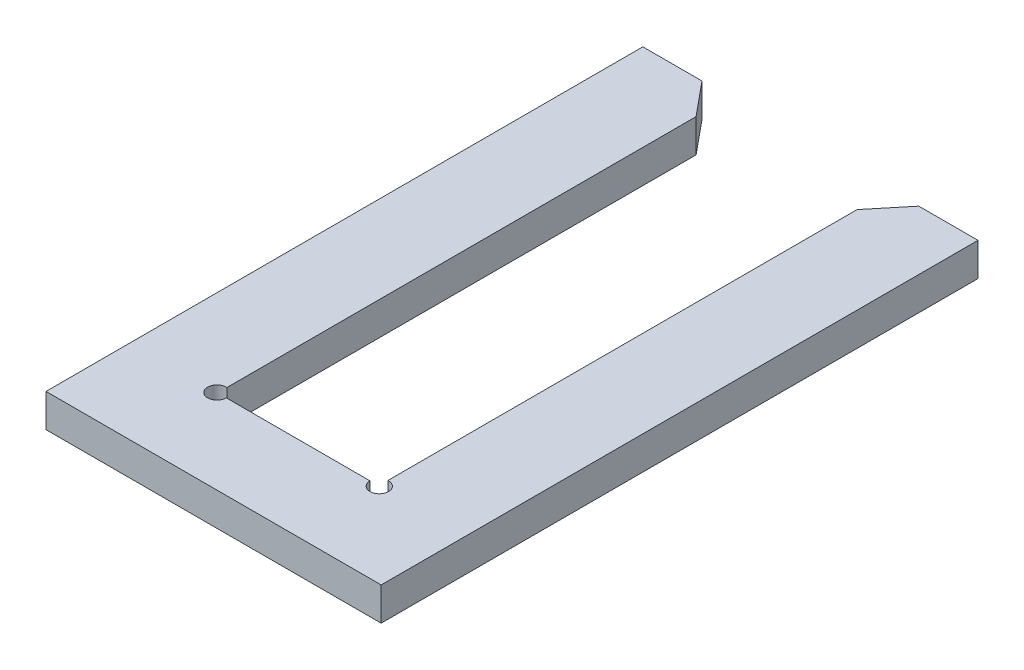
ISO-10303-21;
HEADER;
FILE_DESCRIPTION(('STEP AP214'),'2;1');
FILE_NAME('part.step','',(''),(''),'','','');
FILE_SCHEMA(('AUTOMOTIVE_DESIGN { 1 0 10303 214 1 1 1 1 }'));
ENDSEC;
DATA;
#1=APPLICATION_CONTEXT('core data for automotive mechanical design processes');
#2=APPLICATION_PROTOCOL_DEFINITION('international standard','automotive_design',2000,#1);
#3=PRODUCT_CONTEXT('',#1,'mechanical');
#4=PRODUCT('Part','Part','',(#3));
#5=PRODUCT_RELATED_PRODUCT_CATEGORY('part','',(#4));
#6=PRODUCT_DEFINITION_FORMATION('','',#4);
#7=PRODUCT_DEFINITION_CONTEXT('part definition',#1,'design');
#8=PRODUCT_DEFINITION('design','',#6,#7);
#9=PRODUCT_DEFINITION_SHAPE('','',#8);
#10=(LENGTH_UNIT() NAMED_UNIT(*) SI_UNIT(.MILLI.,.METRE.));
#11=(NAMED_UNIT(*) PLANE_ANGLE_UNIT() SI_UNIT($,.RADIAN.));
#12=(NAMED_UNIT(*) SI_UNIT($,.STERADIAN.) SOLID_ANGLE_UNIT());
#13=UNCERTAINTY_MEASURE_WITH_UNIT(LENGTH_MEASURE(1.E-05),#10,'distance_accuracy_value','');
#14=(GEOMETRIC_REPRESENTATION_CONTEXT(3) GLOBAL_UNCERTAINTY_ASSIGNED_CONTEXT((#13)) GLOBAL_UNIT_ASSIGNED_CONTEXT((#10,
#11,#12)) REPRESENTATION_CONTEXT('',''));
#15=CARTESIAN_POINT('',(0.,0.,0.));
#16=DIRECTION('',(0.,0.,1.));
#17=DIRECTION('',(1.,0.,0.));
#18=AXIS2_PLACEMENT_3D('',#15,#16,#17);
#19=CARTESIAN_POINT('',(0.,1.96,0.));
#20=DIRECTION('',(0.,0.,-1.));
#21=DIRECTION('',(-1.,0.,0.));
#22=AXIS2_PLACEMENT_3D('',#19,#20,#21);
#23=PLANE('',#22);
#24=DIRECTION('',(1.,0.,0.));
#25=VECTOR('',#24,1.);
#26=CARTESIAN_POINT('',(0.,0.,0.));
#27=LINE('',#26,#25);
#28=CARTESIAN_POINT('',(-9.91136363636364,0.,0.));
#29=VERTEX_POINT('',#28);
#30=CARTESIAN_POINT('',(9.91136363636364,0.,0.));
#31=VERTEX_POINT('',#30);
#32=EDGE_CURVE('E107',#29,#31,#27,.T.);
#33=ORIENTED_EDGE('',*,*,#32,.T.);
#34=DIRECTION('',(0.,-1.,0.));
#35=VECTOR('',#34,1.);
#36=CARTESIAN_POINT('',(9.91136363636364,1.96,0.));
#37=LINE('',#36,#35);
#38=CARTESIAN_POINT('',(9.91136363636364,1.96,0.));
#39=VERTEX_POINT('',#38);
#40=EDGE_CURVE('E10',#39,#31,#37,.T.);
#41=ORIENTED_EDGE('',*,*,#40,.F.);
#42=DIRECTION('',(1.,0.,0.));
#43=VECTOR('',#42,1.);
#44=CARTESIAN_POINT('',(0.,1.96,0.));
#45=LINE('',#44,#43);
#46=CARTESIAN_POINT('',(-9.91136363636364,1.96,0.));
#47=VERTEX_POINT('',#46);
#48=EDGE_CURVE('E70',#47,#39,#45,.T.);
#49=ORIENTED_EDGE('',*,*,#48,.F.);
#50=DIRECTION('',(0.,-1.,0.));
#51=VECTOR('',#50,1.);
#52=CARTESIAN_POINT('',(-9.91136363636364,1.96,0.));
#53=LINE('',#52,#51);
#54=EDGE_CURVE('E166',#47,#29,#53,.T.);
#55=ORIENTED_EDGE('',*,*,#54,.T.);
#56=EDGE_LOOP('',(#33,#41,#49,#55));
#57=FACE_BOUND('',#56,.T.);
#58=ADVANCED_FACE('F16',(#57),#23,.F.);
#59=CARTESIAN_POINT('',(9.91136363636364,1.96,0.));
#60=DIRECTION('',(-1.,0.,0.));
#61=DIRECTION('',(0.,0.,1.));
#62=AXIS2_PLACEMENT_3D('',#59,#60,#61);
#63=PLANE('',#62);
#64=DIRECTION('',(0.,0.,-1.));
#65=VECTOR('',#64,1.);
#66=CARTESIAN_POINT('',(9.91136363636364,0.,0.));
#67=LINE('',#66,#65);
#68=CARTESIAN_POINT('',(9.91136363636364,0.,-35.3));
#69=VERTEX_POINT('',#68);
#70=EDGE_CURVE('E109',#31,#69,#67,.T.);
#71=ORIENTED_EDGE('',*,*,#70,.T.);
#72=DIRECTION('',(0.,-1.,0.));
#73=VECTOR('',#72,1.);
#74=CARTESIAN_POINT('',(9.91136363636364,1.96,-35.3));
#75=LINE('',#74,#73);
#76=CARTESIAN_POINT('',(9.91136363636364,1.96,-35.3));
#77=VERTEX_POINT('',#76);
#78=EDGE_CURVE('E24',#77,#69,#75,.T.);
#79=ORIENTED_EDGE('',*,*,#78,.F.);
#80=DIRECTION('',(0.,0.,-1.));
#81=VECTOR('',#80,1.);
#82=CARTESIAN_POINT('',(9.91136363636364,1.96,0.));
#83=LINE('',#82,#81);
#84=EDGE_CURVE('E161',#39,#77,#83,.T.);
#85=ORIENTED_EDGE('',*,*,#84,.F.);
#86=ORIENTED_EDGE('',*,*,#40,.T.);
#87=EDGE_LOOP('',(#71,#79,#85,#86));
#88=FACE_BOUND('',#87,.T.);
#89=ADVANCED_FACE('F162',(#88),#63,.F.);
#90=CARTESIAN_POINT('',(9.91136363636364,1.96,-35.3));
#91=DIRECTION('',(0.,0.,1.));
#92=DIRECTION('',(1.,0.,0.));
#93=AXIS2_PLACEMENT_3D('',#90,#91,#92);
#94=PLANE('',#93);
#95=DIRECTION('',(-1.,0.,0.));
#96=VECTOR('',#95,1.);
#97=CARTESIAN_POINT('',(9.91136363636364,0.,-35.3));
#98=LINE('',#97,#96);
#99=CARTESIAN_POINT('',(6.41136363636364,0.,-35.3));
#100=VERTEX_POINT('',#99);
#101=EDGE_CURVE('E112',#69,#100,#98,.T.);
#102=ORIENTED_EDGE('',*,*,#101,.T.);
#103=DIRECTION('',(0.,-1.,0.));
#104=VECTOR('',#103,1.);
#105=CARTESIAN_POINT('',(6.41136363636364,1.96,-35.3));
#106=LINE('',#105,#104);
#107=CARTESIAN_POINT('',(6.41136363636364,1.96,-35.3));
#108=VERTEX_POINT('',#107);
#109=EDGE_CURVE('E96',#108,#100,#106,.T.);
#110=ORIENTED_EDGE('',*,*,#109,.F.);
#111=DIRECTION('',(-1.,0.,0.));
#112=VECTOR('',#111,1.);
#113=CARTESIAN_POINT('',(9.91136363636364,1.96,-35.3));
#114=LINE('',#113,#112);
#115=EDGE_CURVE('E87',#77,#108,#114,.T.);
#116=ORIENTED_EDGE('',*,*,#115,.F.);
#117=ORIENTED_EDGE('',*,*,#78,.T.);
#118=EDGE_LOOP('',(#102,#110,#116,#117));
#119=FACE_BOUND('',#118,.T.);
#120=ADVANCED_FACE('F126',(#119),#94,.F.);
#121=CARTESIAN_POINT('',(6.41136363636364,1.96,-35.3));
#122=DIRECTION('',(0.771377398024086,0.,0.63637796144869));
#123=DIRECTION('',(0.63637796144869,0.,-0.771377398024087));
#124=AXIS2_PLACEMENT_3D('',#121,#122,#123);
#125=PLANE('',#124);
#126=DIRECTION('',(-0.63637796144869,0.,0.771377398024086));
#127=VECTOR('',#126,1.);
#128=CARTESIAN_POINT('',(6.41136363636364,0.,-35.3));
#129=LINE('',#128,#127);
#130=CARTESIAN_POINT('',(4.76136363636363,0.,-33.2999736259843));
#131=VERTEX_POINT('',#130);
#132=EDGE_CURVE('E95',#100,#131,#129,.T.);
#133=ORIENTED_EDGE('',*,*,#132,.T.);
#134=DIRECTION('',(0.,-1.,0.));
#135=VECTOR('',#134,1.);
#136=CARTESIAN_POINT('',(4.76136363636363,1.96,-33.2999736259843));
#137=LINE('',#136,#135);
#138=CARTESIAN_POINT('',(4.76136363636363,1.96,-33.2999736259843));
#139=VERTEX_POINT('',#138);
#140=EDGE_CURVE('E92',#139,#131,#137,.T.);
#141=ORIENTED_EDGE('',*,*,#140,.F.);
#142=DIRECTION('',(-0.63637796144869,0.,0.771377398024086));
#143=VECTOR('',#142,1.);
#144=CARTESIAN_POINT('',(6.41136363636364,1.96,-35.3));
#145=LINE('',#144,#143);
#146=EDGE_CURVE('E81',#108,#139,#145,.T.);
#147=ORIENTED_EDGE('',*,*,#146,.F.);
#148=ORIENTED_EDGE('',*,*,#109,.T.);
#149=EDGE_LOOP('',(#133,#141,#147,#148));
#150=FACE_BOUND('',#149,.T.);
#151=ADVANCED_FACE('F93',(#150),#125,.F.);
#152=CARTESIAN_POINT('',(4.76136363636363,1.96,-33.2999736259843));
#153=DIRECTION('',(1.,0.,0.));
#154=DIRECTION('',(0.,0.,-1.));
#155=AXIS2_PLACEMENT_3D('',#152,#153,#154);
#156=PLANE('',#155);
#157=DIRECTION('',(0.,0.,1.));
#158=VECTOR('',#157,1.);
#159=CARTESIAN_POINT('',(4.76136363636363,0.,-33.2999736259843));
#160=LINE('',#159,#158);
#161=CARTESIAN_POINT('',(4.76136363636364,0.,-5.54864125929879));
#162=VERTEX_POINT('',#161);
#163=EDGE_CURVE('E56',#131,#162,#160,.T.);
#164=ORIENTED_EDGE('',*,*,#163,.T.);
#165=DIRECTION('',(0.,-1.,0.));
#166=VECTOR('',#165,1.);
#167=CARTESIAN_POINT('',(4.76136363636364,1.96,-5.54864125929879));
#168=LINE('',#167,#166);
#169=CARTESIAN_POINT('',(4.76136363636364,1.96,-5.54864125929879));
#170=VERTEX_POINT('',#169);
#171=EDGE_CURVE('E97',#170,#162,#168,.T.);
#172=ORIENTED_EDGE('',*,*,#171,.F.);
#173=DIRECTION('',(0.,0.,1.));
#174=VECTOR('',#173,1.);
#175=CARTESIAN_POINT('',(4.76136363636363,1.96,-33.2999736259843));
#176=LINE('',#175,#174);
#177=EDGE_CURVE('E85',#139,#170,#176,.T.);
#178=ORIENTED_EDGE('',*,*,#177,.F.);
#179=ORIENTED_EDGE('',*,*,#140,.T.);
#180=EDGE_LOOP('',(#164,#172,#178,#179));
#181=FACE_BOUND('',#180,.T.);
#182=ADVANCED_FACE('F99',(#181),#156,.F.);
#183=CARTESIAN_POINT('',(4.8,1.96,-5.));
#184=DIRECTION('',(0.,-1.,0.));
#185=DIRECTION('',(0.,0.,-1.));
#186=AXIS2_PLACEMENT_3D('',#183,#184,#185);
#187=CYLINDRICAL_SURFACE('',#186,0.55);
#188=CARTESIAN_POINT('',(4.8,0.,-5.));
#189=DIRECTION('',(0.,-1.,0.));
#190=DIRECTION('',(0.,0.,1.));
#191=AXIS2_PLACEMENT_3D('',#188,#189,#190);
#192=CIRCLE('',#191,0.55);
#193=CARTESIAN_POINT('',(4.25,0.,-5.));
#194=VERTEX_POINT('',#193);
#195=EDGE_CURVE('E62',#162,#194,#192,.T.);
#196=ORIENTED_EDGE('',*,*,#195,.T.);
#197=DIRECTION('',(0.,-1.,0.));
#198=VECTOR('',#197,1.);
#199=CARTESIAN_POINT('',(4.25,1.96,-5.));
#200=LINE('',#199,#198);
#201=CARTESIAN_POINT('',(4.25,1.96,-5.));
#202=VERTEX_POINT('',#201);
#203=EDGE_CURVE('E106',#202,#194,#200,.T.);
#204=ORIENTED_EDGE('',*,*,#203,.F.);
#205=CARTESIAN_POINT('',(4.8,1.96,-5.));
#206=DIRECTION('',(0.,-1.,0.));
#207=DIRECTION('',(0.,0.,1.));
#208=AXIS2_PLACEMENT_3D('',#205,#206,#207);
#209=CIRCLE('',#208,0.55);
#210=EDGE_CURVE('E32',#170,#202,#209,.T.);
#211=ORIENTED_EDGE('',*,*,#210,.F.);
#212=ORIENTED_EDGE('',*,*,#171,.T.);
#213=EDGE_LOOP('',(#196,#204,#211,#212));
#214=FACE_BOUND('',#213,.T.);
#215=ADVANCED_FACE('F254',(#214),#187,.F.);
#216=CARTESIAN_POINT('',(4.25,1.96,-5.));
#217=DIRECTION('',(0.,0.,1.));
#218=DIRECTION('',(1.,0.,0.));
#219=AXIS2_PLACEMENT_3D('',#216,#217,#218);
#220=PLANE('',#219);
#221=DIRECTION('',(-1.,0.,0.));
#222=VECTOR('',#221,1.);
#223=CARTESIAN_POINT('',(4.25,0.,-5.));
#224=LINE('',#223,#222);
#225=CARTESIAN_POINT('',(-4.25,0.,-5.));
#226=VERTEX_POINT('',#225);
#227=EDGE_CURVE('E117',#194,#226,#224,.T.);
#228=ORIENTED_EDGE('',*,*,#227,.T.);
#229=DIRECTION('',(0.,-1.,0.));
#230=VECTOR('',#229,1.);
#231=CARTESIAN_POINT('',(-4.25,1.96,-5.));
#232=LINE('',#231,#230);
#233=CARTESIAN_POINT('',(-4.25,1.96,-5.));
#234=VERTEX_POINT('',#233);
#235=EDGE_CURVE('E110',#234,#226,#232,.T.);
#236=ORIENTED_EDGE('',*,*,#235,.F.);
#237=DIRECTION('',(-1.,0.,0.));
#238=VECTOR('',#237,1.);
#239=CARTESIAN_POINT('',(4.25,1.96,-5.));
#240=LINE('',#239,#238);
#241=EDGE_CURVE('E101',#202,#234,#240,.T.);
#242=ORIENTED_EDGE('',*,*,#241,.F.);
#243=ORIENTED_EDGE('',*,*,#203,.T.);
#244=EDGE_LOOP('',(#228,#236,#242,#243));
#245=FACE_BOUND('',#244,.T.);
#246=ADVANCED_FACE('F142',(#245),#220,.F.);
#247=CARTESIAN_POINT('',(4.8,1.96,-5.));
#248=DIRECTION('',(0.,1.,0.));
#249=DIRECTION('',(0.,0.,1.));
#250=AXIS2_PLACEMENT_3D('',#247,#248,#249);
#251=PLANE('',#250);
#252=ORIENTED_EDGE('',*,*,#241,.T.);
#253=CARTESIAN_POINT('',(-4.8,1.96,-5.));
#254=DIRECTION('',(0.,1.,0.));
#255=DIRECTION('',(0.,0.,1.));
#256=AXIS2_PLACEMENT_3D('',#253,#254,#255);
#257=CIRCLE('',#256,0.55);
#258=CARTESIAN_POINT('',(-4.76136363636364,1.96,-5.54864125929879));
#259=VERTEX_POINT('',#258);
#260=EDGE_CURVE('E152',#259,#234,#257,.T.);
#261=ORIENTED_EDGE('',*,*,#260,.F.);
#262=DIRECTION('',(0.,0.,1.));
#263=VECTOR('',#262,1.);
#264=CARTESIAN_POINT('',(-4.76136363636364,1.96,-33.2999736259843));
#265=LINE('',#264,#263);
#266=CARTESIAN_POINT('',(-4.76136363636364,1.96,-33.2999736259843));
#267=VERTEX_POINT('',#266);
#268=EDGE_CURVE('E202',#267,#259,#265,.T.);
#269=ORIENTED_EDGE('',*,*,#268,.F.);
#270=DIRECTION('',(0.63637796144869,0.,0.771377398024086));
#271=VECTOR('',#270,1.);
#272=CARTESIAN_POINT('',(-6.41136363636364,1.96,-35.3));
#273=LINE('',#272,#271);
#274=CARTESIAN_POINT('',(-6.41136363636364,1.96,-35.3));
#275=VERTEX_POINT('',#274);
#276=EDGE_CURVE('E206',#275,#267,#273,.T.);
#277=ORIENTED_EDGE('',*,*,#276,.F.);
#278=DIRECTION('',(1.,0.,0.));
#279=VECTOR('',#278,1.);
#280=CARTESIAN_POINT('',(-9.91136363636364,1.96,-35.3));
#281=LINE('',#280,#279);
#282=CARTESIAN_POINT('',(-9.91136363636364,1.96,-35.3));
#283=VERTEX_POINT('',#282);
#284=EDGE_CURVE('E208',#283,#275,#281,.T.);
#285=ORIENTED_EDGE('',*,*,#284,.F.);
#286=DIRECTION('',(0.,0.,-1.));
#287=VECTOR('',#286,1.);
#288=CARTESIAN_POINT('',(-9.91136363636364,1.96,0.));
#289=LINE('',#288,#287);
#290=EDGE_CURVE('E213',#47,#283,#289,.T.);
#291=ORIENTED_EDGE('',*,*,#290,.F.);
#292=ORIENTED_EDGE('',*,*,#48,.T.);
#293=ORIENTED_EDGE('',*,*,#84,.T.);
#294=ORIENTED_EDGE('',*,*,#115,.T.);
#295=ORIENTED_EDGE('',*,*,#146,.T.);
#296=ORIENTED_EDGE('',*,*,#177,.T.);
#297=ORIENTED_EDGE('',*,*,#210,.T.);
#298=EDGE_LOOP('',(#252,#261,#269,#277,#285,#291,#292,#293,#294,#295,#296,#297));
#299=FACE_BOUND('',#298,.T.);
#300=ADVANCED_FACE('F83',(#299),#251,.T.);
#301=CARTESIAN_POINT('',(4.8,0.,-5.));
#302=DIRECTION('',(0.,1.,0.));
#303=DIRECTION('',(0.,0.,1.));
#304=AXIS2_PLACEMENT_3D('',#301,#302,#303);
#305=PLANE('',#304);
#306=ORIENTED_EDGE('',*,*,#32,.F.);
#307=DIRECTION('',(0.,0.,-1.));
#308=VECTOR('',#307,1.);
#309=CARTESIAN_POINT('',(-9.91136363636364,0.,0.));
#310=LINE('',#309,#308);
#311=CARTESIAN_POINT('',(-9.91136363636364,0.,-35.3));
#312=VERTEX_POINT('',#311);
#313=EDGE_CURVE('E171',#29,#312,#310,.T.);
#314=ORIENTED_EDGE('',*,*,#313,.T.);
#315=DIRECTION('',(1.,0.,0.));
#316=VECTOR('',#315,1.);
#317=CARTESIAN_POINT('',(-9.91136363636364,0.,-35.3));
#318=LINE('',#317,#316);
#319=CARTESIAN_POINT('',(-6.41136363636364,0.,-35.3));
#320=VERTEX_POINT('',#319);
#321=EDGE_CURVE('E221',#312,#320,#318,.T.);
#322=ORIENTED_EDGE('',*,*,#321,.T.);
#323=DIRECTION('',(0.63637796144869,0.,0.771377398024086));
#324=VECTOR('',#323,1.);
#325=CARTESIAN_POINT('',(-6.41136363636364,0.,-35.3));
#326=LINE('',#325,#324);
#327=CARTESIAN_POINT('',(-4.76136363636364,0.,-33.2999736259843));
#328=VERTEX_POINT('',#327);
#329=EDGE_CURVE('E218',#320,#328,#326,.T.);
#330=ORIENTED_EDGE('',*,*,#329,.T.);
#331=DIRECTION('',(0.,0.,1.));
#332=VECTOR('',#331,1.);
#333=CARTESIAN_POINT('',(-4.76136363636364,0.,-33.2999736259843));
#334=LINE('',#333,#332);
#335=CARTESIAN_POINT('',(-4.76136363636364,0.,-5.54864125929879));
#336=VERTEX_POINT('',#335);
#337=EDGE_CURVE('E216',#328,#336,#334,.T.);
#338=ORIENTED_EDGE('',*,*,#337,.T.);
#339=CARTESIAN_POINT('',(-4.8,0.,-5.));
#340=DIRECTION('',(0.,1.,0.));
#341=DIRECTION('',(0.,0.,1.));
#342=AXIS2_PLACEMENT_3D('',#339,#340,#341);
#343=CIRCLE('',#342,0.55);
#344=EDGE_CURVE('E138',#336,#226,#343,.T.);
#345=ORIENTED_EDGE('',*,*,#344,.T.);
#346=ORIENTED_EDGE('',*,*,#227,.F.);
#347=ORIENTED_EDGE('',*,*,#195,.F.);
#348=ORIENTED_EDGE('',*,*,#163,.F.);
#349=ORIENTED_EDGE('',*,*,#132,.F.);
#350=ORIENTED_EDGE('',*,*,#101,.F.);
#351=ORIENTED_EDGE('',*,*,#70,.F.);
#352=EDGE_LOOP('',(#306,#314,#322,#330,#338,#345,#346,#347,#348,#349,#350,#351));
#353=FACE_BOUND('',#352,.T.);
#354=ADVANCED_FACE('F132',(#353),#305,.F.);
#355=CARTESIAN_POINT('',(-4.8,1.96,-5.));
#356=DIRECTION('',(0.,-1.,0.));
#357=DIRECTION('',(0.,0.,-1.));
#358=AXIS2_PLACEMENT_3D('',#355,#356,#357);
#359=CYLINDRICAL_SURFACE('',#358,0.55);
#360=ORIENTED_EDGE('',*,*,#344,.F.);
#361=DIRECTION('',(0.,-1.,0.));
#362=VECTOR('',#361,1.);
#363=CARTESIAN_POINT('',(-4.76136363636364,1.96,-5.54864125929879));
#364=LINE('',#363,#362);
#365=EDGE_CURVE('E153',#259,#336,#364,.T.);
#366=ORIENTED_EDGE('',*,*,#365,.F.);
#367=ORIENTED_EDGE('',*,*,#260,.T.);
#368=ORIENTED_EDGE('',*,*,#235,.T.);
#369=EDGE_LOOP('',(#360,#366,#367,#368));
#370=FACE_BOUND('',#369,.T.);
#371=ADVANCED_FACE('F149',(#370),#359,.F.);
#372=CARTESIAN_POINT('',(-4.76136363636364,1.96,-33.2999736259843));
#373=DIRECTION('',(1.,0.,0.));
#374=DIRECTION('',(0.,0.,-1.));
#375=AXIS2_PLACEMENT_3D('',#372,#373,#374);
#376=PLANE('',#375);
#377=ORIENTED_EDGE('',*,*,#337,.F.);
#378=DIRECTION('',(0.,-1.,0.));
#379=VECTOR('',#378,1.);
#380=CARTESIAN_POINT('',(-4.76136363636364,1.96,-33.2999736259843));
#381=LINE('',#380,#379);
#382=EDGE_CURVE('E156',#267,#328,#381,.T.);
#383=ORIENTED_EDGE('',*,*,#382,.F.);
#384=ORIENTED_EDGE('',*,*,#268,.T.);
#385=ORIENTED_EDGE('',*,*,#365,.T.);
#386=EDGE_LOOP('',(#377,#383,#384,#385));
#387=FACE_BOUND('',#386,.T.);
#388=ADVANCED_FACE('F205',(#387),#376,.T.);
#389=CARTESIAN_POINT('',(-6.41136363636364,1.96,-35.3));
#390=DIRECTION('',(0.771377398024086,0.,-0.63637796144869));
#391=DIRECTION('',(-0.63637796144869,0.,-0.771377398024086));
#392=AXIS2_PLACEMENT_3D('',#389,#390,#391);
#393=PLANE('',#392);
#394=ORIENTED_EDGE('',*,*,#329,.F.);
#395=DIRECTION('',(0.,-1.,0.));
#396=VECTOR('',#395,1.);
#397=CARTESIAN_POINT('',(-6.41136363636364,1.96,-35.3));
#398=LINE('',#397,#396);
#399=EDGE_CURVE('E226',#275,#320,#398,.T.);
#400=ORIENTED_EDGE('',*,*,#399,.F.);
#401=ORIENTED_EDGE('',*,*,#276,.T.);
#402=ORIENTED_EDGE('',*,*,#382,.T.);
#403=EDGE_LOOP('',(#394,#400,#401,#402));
#404=FACE_BOUND('',#403,.T.);
#405=ADVANCED_FACE('F229',(#404),#393,.T.);
#406=CARTESIAN_POINT('',(-9.91136363636364,1.96,-35.3));
#407=DIRECTION('',(0.,0.,-1.));
#408=DIRECTION('',(-1.,0.,0.));
#409=AXIS2_PLACEMENT_3D('',#406,#407,#408);
#410=PLANE('',#409);
#411=ORIENTED_EDGE('',*,*,#321,.F.);
#412=DIRECTION('',(0.,-1.,0.));
#413=VECTOR('',#412,1.);
#414=CARTESIAN_POINT('',(-9.91136363636364,1.96,-35.3));
#415=LINE('',#414,#413);
#416=EDGE_CURVE('E179',#283,#312,#415,.T.);
#417=ORIENTED_EDGE('',*,*,#416,.F.);
#418=ORIENTED_EDGE('',*,*,#284,.T.);
#419=ORIENTED_EDGE('',*,*,#399,.T.);
#420=EDGE_LOOP('',(#411,#417,#418,#419));
#421=FACE_BOUND('',#420,.T.);
#422=ADVANCED_FACE('F231',(#421),#410,.T.);
#423=CARTESIAN_POINT('',(-9.91136363636364,1.96,0.));
#424=DIRECTION('',(-1.,0.,0.));
#425=DIRECTION('',(0.,0.,1.));
#426=AXIS2_PLACEMENT_3D('',#423,#424,#425);
#427=PLANE('',#426);
#428=ORIENTED_EDGE('',*,*,#313,.F.);
#429=ORIENTED_EDGE('',*,*,#54,.F.);
#430=ORIENTED_EDGE('',*,*,#290,.T.);
#431=ORIENTED_EDGE('',*,*,#416,.T.);
#432=EDGE_LOOP('',(#428,#429,#430,#431));
#433=FACE_BOUND('',#432,.T.);
#434=ADVANCED_FACE('F233',(#433),#427,.T.);
#435=CLOSED_SHELL('',(#58,#89,#120,#151,#182,#215,#246,#300,#354,#371,#388,#405,#422,#434));
#436=MANIFOLD_SOLID_BREP('B1',#435);
#437=ADVANCED_BREP_SHAPE_REPRESENTATION('',(#18,#436),#14);
#438=SHAPE_DEFINITION_REPRESENTATION(#9,#437);
ENDSEC;
END-ISO-10303-21;
